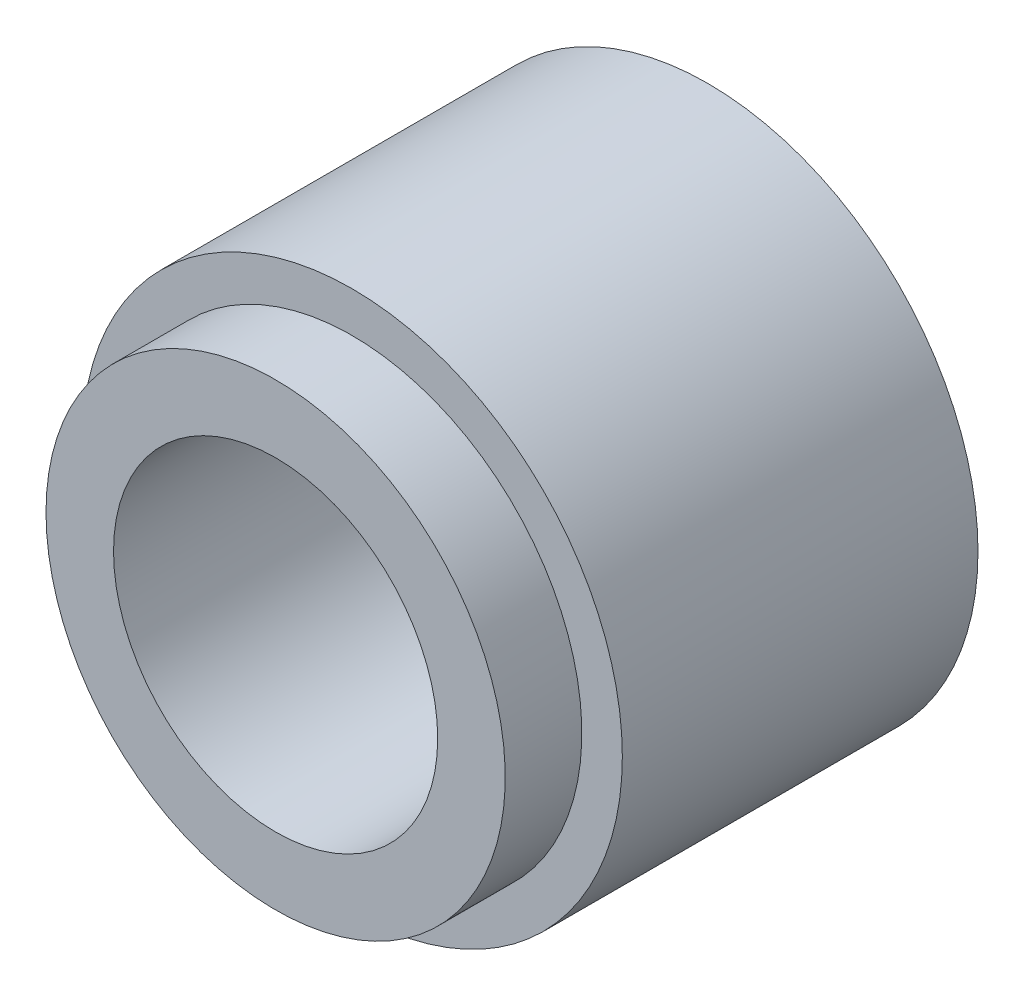
ISO-10303-21;
HEADER;
FILE_DESCRIPTION(('STEP AP214'),'2;1');
FILE_NAME('part.step','',(''),(''),'','','');
FILE_SCHEMA(('AUTOMOTIVE_DESIGN { 1 0 10303 214 1 1 1 1 }'));
ENDSEC;
DATA;
#1=APPLICATION_CONTEXT('core data for automotive mechanical design processes');
#2=APPLICATION_PROTOCOL_DEFINITION('international standard','automotive_design',2000,#1);
#3=PRODUCT_CONTEXT('',#1,'mechanical');
#4=PRODUCT('Part','Part','',(#3));
#5=PRODUCT_RELATED_PRODUCT_CATEGORY('part','',(#4));
#6=PRODUCT_DEFINITION_FORMATION('','',#4);
#7=PRODUCT_DEFINITION_CONTEXT('part definition',#1,'design');
#8=PRODUCT_DEFINITION('design','',#6,#7);
#9=PRODUCT_DEFINITION_SHAPE('','',#8);
#10=(LENGTH_UNIT() NAMED_UNIT(*) SI_UNIT(.MILLI.,.METRE.));
#11=(NAMED_UNIT(*) PLANE_ANGLE_UNIT() SI_UNIT($,.RADIAN.));
#12=(NAMED_UNIT(*) SI_UNIT($,.STERADIAN.) SOLID_ANGLE_UNIT());
#13=UNCERTAINTY_MEASURE_WITH_UNIT(LENGTH_MEASURE(1.E-05),#10,'distance_accuracy_value','');
#14=(GEOMETRIC_REPRESENTATION_CONTEXT(3) GLOBAL_UNCERTAINTY_ASSIGNED_CONTEXT((#13)) GLOBAL_UNIT_ASSIGNED_CONTEXT((#10,
#11,#12)) REPRESENTATION_CONTEXT('',''));
#15=CARTESIAN_POINT('',(0.,0.,0.));
#16=DIRECTION('',(0.,0.,1.));
#17=DIRECTION('',(1.,0.,0.));
#18=AXIS2_PLACEMENT_3D('',#15,#16,#17);
#19=CARTESIAN_POINT('',(0.,0.,-25.4));
#20=DIRECTION('',(0.,0.,-1.));
#21=DIRECTION('',(-1.,0.,0.));
#22=AXIS2_PLACEMENT_3D('',#19,#20,#21);
#23=CYLINDRICAL_SURFACE('',#22,31.75);
#24=CARTESIAN_POINT('',(0.,0.,16.4));
#25=DIRECTION('',(0.,0.,-1.));
#26=DIRECTION('',(-1.,0.,0.));
#27=AXIS2_PLACEMENT_3D('',#24,#25,#26);
#28=CIRCLE('',#27,31.75);
#29=CARTESIAN_POINT('',(-31.75,0.,16.4));
#30=VERTEX_POINT('',#29);
#31=EDGE_CURVE('E10',#30,#30,#28,.T.);
#32=ORIENTED_EDGE('',*,*,#31,.T.);
#33=EDGE_LOOP('',(#32));
#34=FACE_BOUND('',#33,.T.);
#35=CARTESIAN_POINT('',(0.,0.,-25.4));
#36=DIRECTION('',(0.,0.,-1.));
#37=DIRECTION('',(-1.,0.,0.));
#38=AXIS2_PLACEMENT_3D('',#35,#36,#37);
#39=CIRCLE('',#38,31.75);
#40=CARTESIAN_POINT('',(-31.75,0.,-25.4));
#41=VERTEX_POINT('',#40);
#42=EDGE_CURVE('E53',#41,#41,#39,.T.);
#43=ORIENTED_EDGE('',*,*,#42,.F.);
#44=EDGE_LOOP('',(#43));
#45=FACE_BOUND('',#44,.T.);
#46=ADVANCED_FACE('F31',(#34,#45),#23,.T.);
#47=CARTESIAN_POINT('',(0.,26.9875,16.4));
#48=DIRECTION('',(0.,0.,1.));
#49=DIRECTION('',(1.,0.,0.));
#50=AXIS2_PLACEMENT_3D('',#47,#48,#49);
#51=PLANE('',#50);
#52=CARTESIAN_POINT('',(0.,0.,16.4));
#53=DIRECTION('',(0.,0.,-1.));
#54=DIRECTION('',(-1.,0.,0.));
#55=AXIS2_PLACEMENT_3D('',#52,#53,#54);
#56=CIRCLE('',#55,26.9875);
#57=CARTESIAN_POINT('',(-26.9875,0.,16.4));
#58=VERTEX_POINT('',#57);
#59=EDGE_CURVE('E37',#58,#58,#56,.T.);
#60=ORIENTED_EDGE('',*,*,#59,.T.);
#61=EDGE_LOOP('',(#60));
#62=FACE_BOUND('',#61,.T.);
#63=ORIENTED_EDGE('',*,*,#31,.F.);
#64=EDGE_LOOP('',(#63));
#65=FACE_BOUND('',#64,.T.);
#66=ADVANCED_FACE('F61',(#62,#65),#51,.T.);
#67=CARTESIAN_POINT('',(0.,0.,-25.4));
#68=DIRECTION('',(0.,0.,-1.));
#69=DIRECTION('',(-1.,0.,0.));
#70=AXIS2_PLACEMENT_3D('',#67,#68,#69);
#71=CYLINDRICAL_SURFACE('',#70,26.9875);
#72=CARTESIAN_POINT('',(0.,0.,25.4));
#73=DIRECTION('',(0.,0.,-1.));
#74=DIRECTION('',(-1.,0.,0.));
#75=AXIS2_PLACEMENT_3D('',#72,#73,#74);
#76=CIRCLE('',#75,26.9875);
#77=CARTESIAN_POINT('',(-26.9875,0.,25.4));
#78=VERTEX_POINT('',#77);
#79=EDGE_CURVE('E41',#78,#78,#76,.T.);
#80=ORIENTED_EDGE('',*,*,#79,.T.);
#81=EDGE_LOOP('',(#80));
#82=FACE_BOUND('',#81,.T.);
#83=ORIENTED_EDGE('',*,*,#59,.F.);
#84=EDGE_LOOP('',(#83));
#85=FACE_BOUND('',#84,.T.);
#86=ADVANCED_FACE('F65',(#82,#85),#71,.T.);
#87=CARTESIAN_POINT('',(0.,26.9875,25.4));
#88=DIRECTION('',(0.,0.,1.));
#89=DIRECTION('',(1.,0.,0.));
#90=AXIS2_PLACEMENT_3D('',#87,#88,#89);
#91=PLANE('',#90);
#92=CARTESIAN_POINT('',(0.,0.,25.4));
#93=DIRECTION('',(0.,0.,-1.));
#94=DIRECTION('',(-1.,0.,0.));
#95=AXIS2_PLACEMENT_3D('',#92,#93,#94);
#96=CIRCLE('',#95,19.05);
#97=CARTESIAN_POINT('',(-19.05,0.,25.4));
#98=VERTEX_POINT('',#97);
#99=EDGE_CURVE('E45',#98,#98,#96,.T.);
#100=ORIENTED_EDGE('',*,*,#99,.T.);
#101=EDGE_LOOP('',(#100));
#102=FACE_BOUND('',#101,.T.);
#103=ORIENTED_EDGE('',*,*,#79,.F.);
#104=EDGE_LOOP('',(#103));
#105=FACE_BOUND('',#104,.T.);
#106=ADVANCED_FACE('F69',(#102,#105),#91,.T.);
#107=CARTESIAN_POINT('',(0.,0.,-25.4));
#108=DIRECTION('',(0.,0.,-1.));
#109=DIRECTION('',(-1.,0.,0.));
#110=AXIS2_PLACEMENT_3D('',#107,#108,#109);
#111=CYLINDRICAL_SURFACE('',#110,19.05);
#112=CARTESIAN_POINT('',(0.,0.,-25.4));
#113=DIRECTION('',(0.,0.,-1.));
#114=DIRECTION('',(-1.,0.,0.));
#115=AXIS2_PLACEMENT_3D('',#112,#113,#114);
#116=CIRCLE('',#115,19.05);
#117=CARTESIAN_POINT('',(-19.05,0.,-25.4));
#118=VERTEX_POINT('',#117);
#119=EDGE_CURVE('E50',#118,#118,#116,.T.);
#120=ORIENTED_EDGE('',*,*,#119,.T.);
#121=EDGE_LOOP('',(#120));
#122=FACE_BOUND('',#121,.T.);
#123=ORIENTED_EDGE('',*,*,#99,.F.);
#124=EDGE_LOOP('',(#123));
#125=FACE_BOUND('',#124,.T.);
#126=ADVANCED_FACE('F76',(#122,#125),#111,.F.);
#127=CARTESIAN_POINT('',(0.,19.05,-25.4));
#128=DIRECTION('',(0.,0.,-1.));
#129=DIRECTION('',(-1.,0.,0.));
#130=AXIS2_PLACEMENT_3D('',#127,#128,#129);
#131=PLANE('',#130);
#132=ORIENTED_EDGE('',*,*,#42,.T.);
#133=EDGE_LOOP('',(#132));
#134=FACE_BOUND('',#133,.T.);
#135=ORIENTED_EDGE('',*,*,#119,.F.);
#136=EDGE_LOOP('',(#135));
#137=FACE_BOUND('',#136,.T.);
#138=ADVANCED_FACE('F57',(#134,#137),#131,.T.);
#139=CLOSED_SHELL('',(#46,#66,#86,#106,#126,#138));
#140=MANIFOLD_SOLID_BREP('B2',#139);
#141=ADVANCED_BREP_SHAPE_REPRESENTATION('',(#18,#140),#14);
#142=SHAPE_DEFINITION_REPRESENTATION(#9,#141);
ENDSEC;
END-ISO-10303-21;
